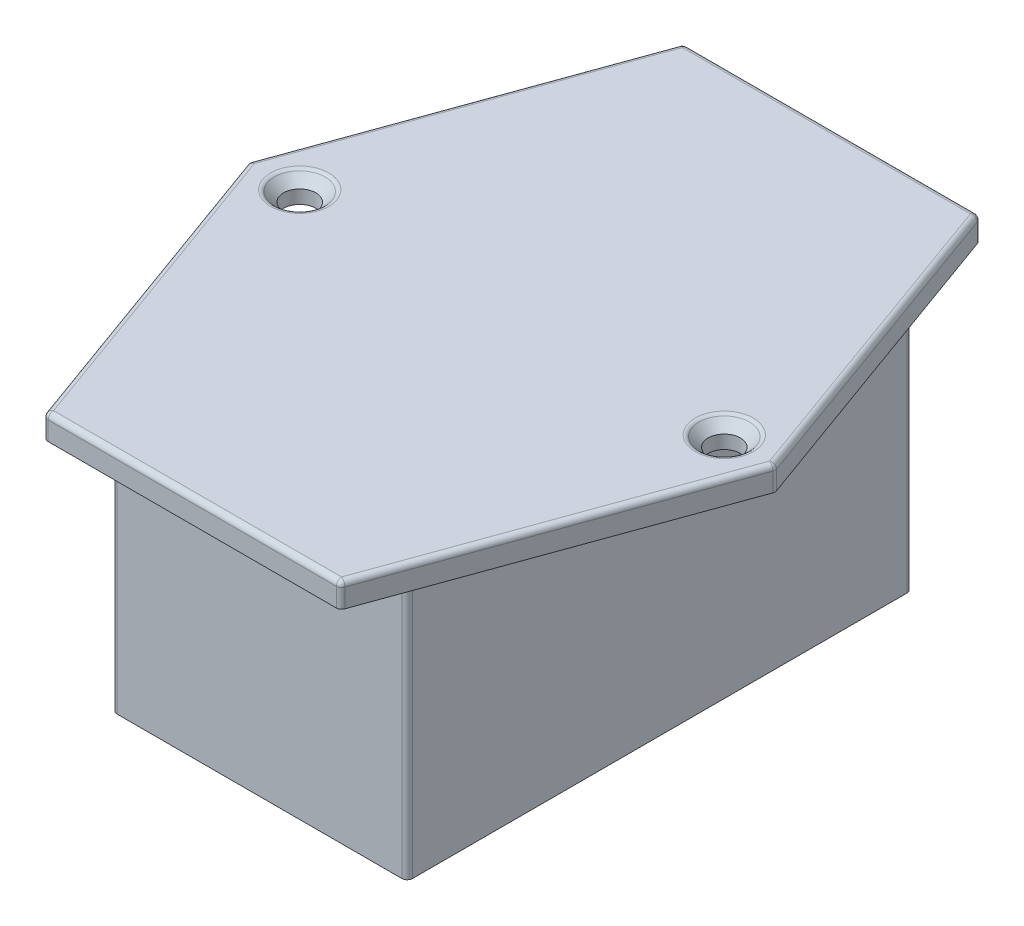
ISO-10303-21;
HEADER;
FILE_DESCRIPTION(('STEP AP214'),'2;1');
FILE_NAME('part.step','',(''),(''),'','','');
FILE_SCHEMA(('AUTOMOTIVE_DESIGN { 1 0 10303 214 1 1 1 1 }'));
ENDSEC;
DATA;
#1=APPLICATION_CONTEXT('core data for automotive mechanical design processes');
#2=APPLICATION_PROTOCOL_DEFINITION('international standard','automotive_design',2000,#1);
#3=PRODUCT_CONTEXT('',#1,'mechanical');
#4=PRODUCT('Part','Part','',(#3));
#5=PRODUCT_RELATED_PRODUCT_CATEGORY('part','',(#4));
#6=PRODUCT_DEFINITION_FORMATION('','',#4);
#7=PRODUCT_DEFINITION_CONTEXT('part definition',#1,'design');
#8=PRODUCT_DEFINITION('design','',#6,#7);
#9=PRODUCT_DEFINITION_SHAPE('','',#8);
#10=(LENGTH_UNIT() NAMED_UNIT(*) SI_UNIT(.MILLI.,.METRE.));
#11=(NAMED_UNIT(*) PLANE_ANGLE_UNIT() SI_UNIT($,.RADIAN.));
#12=(NAMED_UNIT(*) SI_UNIT($,.STERADIAN.) SOLID_ANGLE_UNIT());
#13=UNCERTAINTY_MEASURE_WITH_UNIT(LENGTH_MEASURE(1.E-05),#10,'distance_accuracy_value','');
#14=(GEOMETRIC_REPRESENTATION_CONTEXT(3) GLOBAL_UNCERTAINTY_ASSIGNED_CONTEXT((#13)) GLOBAL_UNIT_ASSIGNED_CONTEXT((#10,
#11,#12)) REPRESENTATION_CONTEXT('',''));
#15=CARTESIAN_POINT('',(0.,0.,0.));
#16=DIRECTION('',(0.,0.,1.));
#17=DIRECTION('',(1.,0.,0.));
#18=AXIS2_PLACEMENT_3D('',#15,#16,#17);
#19=CARTESIAN_POINT('',(0.,25.,0.));
#20=DIRECTION('',(1.,0.,0.));
#21=DIRECTION('',(0.,0.,-1.));
#22=AXIS2_PLACEMENT_3D('',#19,#20,#21);
#23=PLANE('',#22);
#24=DIRECTION('',(0.,0.,1.));
#25=VECTOR('',#24,1.);
#26=CARTESIAN_POINT('',(0.,25.,0.));
#27=LINE('',#26,#25);
#28=CARTESIAN_POINT('',(0.,25.,-46.5));
#29=VERTEX_POINT('',#28);
#30=CARTESIAN_POINT('',(0.,25.,-0.5));
#31=VERTEX_POINT('',#30);
#32=EDGE_CURVE('E385',#29,#31,#27,.T.);
#33=ORIENTED_EDGE('',*,*,#32,.F.);
#34=DIRECTION('',(0.,-1.,0.));
#35=VECTOR('',#34,1.);
#36=CARTESIAN_POINT('',(0.,25.,-46.5));
#37=LINE('',#36,#35);
#38=CARTESIAN_POINT('',(0.,0.,-46.5));
#39=VERTEX_POINT('',#38);
#40=EDGE_CURVE('E288',#29,#39,#37,.T.);
#41=ORIENTED_EDGE('',*,*,#40,.T.);
#42=DIRECTION('',(0.,0.,1.));
#43=VECTOR('',#42,1.);
#44=CARTESIAN_POINT('',(0.,0.,0.));
#45=LINE('',#44,#43);
#46=CARTESIAN_POINT('',(0.,0.,-0.5));
#47=VERTEX_POINT('',#46);
#48=EDGE_CURVE('E384',#39,#47,#45,.T.);
#49=ORIENTED_EDGE('',*,*,#48,.T.);
#50=DIRECTION('',(0.,-1.,0.));
#51=VECTOR('',#50,1.);
#52=CARTESIAN_POINT('',(0.,25.,-0.5));
#53=LINE('',#52,#51);
#54=EDGE_CURVE('E286',#47,#31,#53,.F.);
#55=ORIENTED_EDGE('',*,*,#54,.T.);
#56=EDGE_LOOP('',(#33,#41,#49,#55));
#57=FACE_BOUND('',#56,.T.);
#58=ADVANCED_FACE('F33',(#57),#23,.F.);
#59=CARTESIAN_POINT('',(0.,25.,0.));
#60=DIRECTION('',(0.,0.,-1.));
#61=DIRECTION('',(-1.,0.,0.));
#62=AXIS2_PLACEMENT_3D('',#59,#60,#61);
#63=PLANE('',#62);
#64=DIRECTION('',(1.,0.,0.));
#65=VECTOR('',#64,1.);
#66=CARTESIAN_POINT('',(0.,25.,0.));
#67=LINE('',#66,#65);
#68=CARTESIAN_POINT('',(0.5,25.,0.));
#69=VERTEX_POINT('',#68);
#70=CARTESIAN_POINT('',(27.,25.,0.));
#71=VERTEX_POINT('',#70);
#72=EDGE_CURVE('E388',#69,#71,#67,.T.);
#73=ORIENTED_EDGE('',*,*,#72,.F.);
#74=DIRECTION('',(0.,-1.,0.));
#75=VECTOR('',#74,1.);
#76=CARTESIAN_POINT('',(0.5,25.,0.));
#77=LINE('',#76,#75);
#78=CARTESIAN_POINT('',(0.5,0.,0.));
#79=VERTEX_POINT('',#78);
#80=EDGE_CURVE('E304',#69,#79,#77,.T.);
#81=ORIENTED_EDGE('',*,*,#80,.T.);
#82=DIRECTION('',(1.,0.,0.));
#83=VECTOR('',#82,1.);
#84=CARTESIAN_POINT('',(0.,0.,0.));
#85=LINE('',#84,#83);
#86=CARTESIAN_POINT('',(27.,0.,0.));
#87=VERTEX_POINT('',#86);
#88=EDGE_CURVE('E401',#79,#87,#85,.T.);
#89=ORIENTED_EDGE('',*,*,#88,.T.);
#90=DIRECTION('',(0.,-1.,0.));
#91=VECTOR('',#90,1.);
#92=CARTESIAN_POINT('',(27.,25.,0.));
#93=LINE('',#92,#91);
#94=EDGE_CURVE('E302',#87,#71,#93,.F.);
#95=ORIENTED_EDGE('',*,*,#94,.T.);
#96=EDGE_LOOP('',(#73,#81,#89,#95));
#97=FACE_BOUND('',#96,.T.);
#98=ADVANCED_FACE('F510',(#97),#63,.F.);
#99=CARTESIAN_POINT('',(27.5,25.,0.));
#100=DIRECTION('',(-1.,0.,0.));
#101=DIRECTION('',(0.,0.,1.));
#102=AXIS2_PLACEMENT_3D('',#99,#100,#101);
#103=PLANE('',#102);
#104=DIRECTION('',(0.,0.,-1.));
#105=VECTOR('',#104,1.);
#106=CARTESIAN_POINT('',(27.5,25.,0.));
#107=LINE('',#106,#105);
#108=CARTESIAN_POINT('',(27.5,25.,-0.5));
#109=VERTEX_POINT('',#108);
#110=CARTESIAN_POINT('',(27.5,25.,-46.5));
#111=VERTEX_POINT('',#110);
#112=EDGE_CURVE('E392',#109,#111,#107,.T.);
#113=ORIENTED_EDGE('',*,*,#112,.F.);
#114=DIRECTION('',(0.,-1.,0.));
#115=VECTOR('',#114,1.);
#116=CARTESIAN_POINT('',(27.5,25.,-0.5));
#117=LINE('',#116,#115);
#118=CARTESIAN_POINT('',(27.5,0.,-0.5));
#119=VERTEX_POINT('',#118);
#120=EDGE_CURVE('E308',#109,#119,#117,.T.);
#121=ORIENTED_EDGE('',*,*,#120,.T.);
#122=DIRECTION('',(0.,0.,-1.));
#123=VECTOR('',#122,1.);
#124=CARTESIAN_POINT('',(27.5,0.,0.));
#125=LINE('',#124,#123);
#126=CARTESIAN_POINT('',(27.5,0.,-46.5));
#127=VERTEX_POINT('',#126);
#128=EDGE_CURVE('E403',#119,#127,#125,.T.);
#129=ORIENTED_EDGE('',*,*,#128,.T.);
#130=DIRECTION('',(0.,-1.,0.));
#131=VECTOR('',#130,1.);
#132=CARTESIAN_POINT('',(27.5,25.,-46.5));
#133=LINE('',#132,#131);
#134=EDGE_CURVE('E306',#127,#111,#133,.F.);
#135=ORIENTED_EDGE('',*,*,#134,.T.);
#136=EDGE_LOOP('',(#113,#121,#129,#135));
#137=FACE_BOUND('',#136,.T.);
#138=ADVANCED_FACE('F516',(#137),#103,.F.);
#139=CARTESIAN_POINT('',(0.,25.,-47.));
#140=DIRECTION('',(0.,0.,1.));
#141=DIRECTION('',(1.,0.,0.));
#142=AXIS2_PLACEMENT_3D('',#139,#140,#141);
#143=PLANE('',#142);
#144=DIRECTION('',(-1.,0.,0.));
#145=VECTOR('',#144,1.);
#146=CARTESIAN_POINT('',(0.,0.,-47.));
#147=LINE('',#146,#145);
#148=CARTESIAN_POINT('',(27.,0.,-47.));
#149=VERTEX_POINT('',#148);
#150=CARTESIAN_POINT('',(0.5,0.,-47.));
#151=VERTEX_POINT('',#150);
#152=EDGE_CURVE('E389',#149,#151,#147,.T.);
#153=ORIENTED_EDGE('',*,*,#152,.T.);
#154=DIRECTION('',(0.,-1.,0.));
#155=VECTOR('',#154,1.);
#156=CARTESIAN_POINT('',(0.5,25.,-47.));
#157=LINE('',#156,#155);
#158=CARTESIAN_POINT('',(0.5,25.,-47.));
#159=VERTEX_POINT('',#158);
#160=EDGE_CURVE('E300',#151,#159,#157,.F.);
#161=ORIENTED_EDGE('',*,*,#160,.T.);
#162=DIRECTION('',(-1.,0.,0.));
#163=VECTOR('',#162,1.);
#164=CARTESIAN_POINT('',(0.,25.,-47.));
#165=LINE('',#164,#163);
#166=CARTESIAN_POINT('',(27.,25.,-47.));
#167=VERTEX_POINT('',#166);
#168=EDGE_CURVE('E395',#167,#159,#165,.T.);
#169=ORIENTED_EDGE('',*,*,#168,.F.);
#170=DIRECTION('',(0.,-1.,0.));
#171=VECTOR('',#170,1.);
#172=CARTESIAN_POINT('',(27.,25.,-47.));
#173=LINE('',#172,#171);
#174=EDGE_CURVE('E297',#167,#149,#173,.T.);
#175=ORIENTED_EDGE('',*,*,#174,.T.);
#176=EDGE_LOOP('',(#153,#161,#169,#175));
#177=FACE_BOUND('',#176,.T.);
#178=ADVANCED_FACE('F603',(#177),#143,.F.);
#179=CARTESIAN_POINT('',(0.,0.,0.));
#180=DIRECTION('',(0.,-1.,0.));
#181=DIRECTION('',(0.,0.,-1.));
#182=AXIS2_PLACEMENT_3D('',#179,#180,#181);
#183=PLANE('',#182);
#184=ORIENTED_EDGE('',*,*,#48,.F.);
#185=CARTESIAN_POINT('',(0.5,0.,-46.5));
#186=DIRECTION('',(0.,-1.,0.));
#187=DIRECTION('',(0.,0.,-1.));
#188=AXIS2_PLACEMENT_3D('',#185,#186,#187);
#189=CIRCLE('',#188,0.5);
#190=EDGE_CURVE('E295',#39,#151,#189,.T.);
#191=ORIENTED_EDGE('',*,*,#190,.T.);
#192=ORIENTED_EDGE('',*,*,#152,.F.);
#193=CARTESIAN_POINT('',(27.,0.,-46.5));
#194=DIRECTION('',(0.,-1.,0.));
#195=DIRECTION('',(0.,0.,-1.));
#196=AXIS2_PLACEMENT_3D('',#193,#194,#195);
#197=CIRCLE('',#196,0.5);
#198=EDGE_CURVE('E291',#149,#127,#197,.T.);
#199=ORIENTED_EDGE('',*,*,#198,.T.);
#200=ORIENTED_EDGE('',*,*,#128,.F.);
#201=CARTESIAN_POINT('',(27.,0.,-0.5));
#202=DIRECTION('',(0.,-1.,0.));
#203=DIRECTION('',(0.,0.,-1.));
#204=AXIS2_PLACEMENT_3D('',#201,#202,#203);
#205=CIRCLE('',#204,0.5);
#206=EDGE_CURVE('E50',#119,#87,#205,.T.);
#207=ORIENTED_EDGE('',*,*,#206,.T.);
#208=ORIENTED_EDGE('',*,*,#88,.F.);
#209=CARTESIAN_POINT('',(0.5,0.,-0.5));
#210=DIRECTION('',(0.,-1.,0.));
#211=DIRECTION('',(0.,0.,-1.));
#212=AXIS2_PLACEMENT_3D('',#209,#210,#211);
#213=CIRCLE('',#212,0.5);
#214=EDGE_CURVE('E58',#79,#47,#213,.T.);
#215=ORIENTED_EDGE('',*,*,#214,.T.);
#216=EDGE_LOOP('',(#184,#191,#192,#199,#200,#207,#208,#215));
#217=FACE_BOUND('',#216,.T.);
#218=ADVANCED_FACE('F609',(#217),#183,.T.);
#219=CARTESIAN_POINT('',(0.,27.25,0.));
#220=DIRECTION('',(0.,-1.,0.));
#221=DIRECTION('',(0.,0.,-1.));
#222=AXIS2_PLACEMENT_3D('',#219,#220,#221);
#223=PLANE('',#222);
#224=DIRECTION('',(-0.339838665473642,0.,-0.940483748636357));
#225=VECTOR('',#224,1.);
#226=CARTESIAN_POINT('',(40.873152878961,27.25,-14.7692905360952));
#227=LINE('',#226,#225);
#228=CARTESIAN_POINT('',(37.7183587029282,27.25,-23.5));
#229=VERTEX_POINT('',#228);
#230=CARTESIAN_POINT('',(27.1490309718357,27.25,-52.75));
#231=VERTEX_POINT('',#230);
#232=EDGE_CURVE('E226',#229,#231,#227,.T.);
#233=ORIENTED_EDGE('',*,*,#232,.T.);
#234=DIRECTION('',(-1.,0.,0.));
#235=VECTOR('',#234,1.);
#236=CARTESIAN_POINT('',(0.,27.25,-52.75));
#237=LINE('',#236,#235);
#238=CARTESIAN_POINT('',(0.350969028164248,27.25,-52.75));
#239=VERTEX_POINT('',#238);
#240=EDGE_CURVE('E196',#231,#239,#237,.T.);
#241=ORIENTED_EDGE('',*,*,#240,.T.);
#242=DIRECTION('',(-0.339838665473641,0.,0.940483748636357));
#243=VECTOR('',#242,1.);
#244=CARTESIAN_POINT('',(-16.5491366391109,27.25,-5.9799401300989));
#245=LINE('',#244,#243);
#246=CARTESIAN_POINT('',(-10.2183587029282,27.25,-23.5));
#247=VERTEX_POINT('',#246);
#248=EDGE_CURVE('E214',#239,#247,#245,.T.);
#249=ORIENTED_EDGE('',*,*,#248,.T.);
#250=DIRECTION('',(0.339838665473642,0.,0.940483748636357));
#251=VECTOR('',#250,1.);
#252=CARTESIAN_POINT('',(-1.52733776340824,27.25,0.55189515820634));
#253=LINE('',#252,#251);
#254=CARTESIAN_POINT('',(0.350969028164256,27.25,5.75));
#255=VERTEX_POINT('',#254);
#256=EDGE_CURVE('E220',#247,#255,#253,.T.);
#257=ORIENTED_EDGE('',*,*,#256,.T.);
#258=DIRECTION('',(1.,0.,0.));
#259=VECTOR('',#258,1.);
#260=CARTESIAN_POINT('',(0.,27.25,5.75));
#261=LINE('',#260,#259);
#262=CARTESIAN_POINT('',(27.1490309718358,27.25,5.74999999999999));
#263=VERTEX_POINT('',#262);
#264=EDGE_CURVE('E419',#255,#263,#261,.T.);
#265=ORIENTED_EDGE('',*,*,#264,.T.);
#266=DIRECTION('',(0.339838665473641,0.,-0.940483748636357));
#267=VECTOR('',#266,1.);
#268=CARTESIAN_POINT('',(25.8513540032583,27.25,9.34124556420259));
#269=LINE('',#268,#267);
#270=EDGE_CURVE('E231',#263,#229,#269,.T.);
#271=ORIENTED_EDGE('',*,*,#270,.T.);
#272=EDGE_LOOP('',(#233,#241,#249,#257,#265,#271));
#273=FACE_BOUND('',#272,.T.);
#274=CARTESIAN_POINT('',(33.5,27.25,-23.5));
#275=DIRECTION('',(0.,-1.,0.));
#276=DIRECTION('',(0.,0.,-1.));
#277=AXIS2_PLACEMENT_3D('',#274,#275,#276);
#278=CIRCLE('',#277,2.70710678118654);
#279=CARTESIAN_POINT('',(33.5,27.25,-26.2071067811865));
#280=VERTEX_POINT('',#279);
#281=EDGE_CURVE('E221',#280,#280,#278,.T.);
#282=ORIENTED_EDGE('',*,*,#281,.T.);
#283=EDGE_LOOP('',(#282));
#284=FACE_BOUND('',#283,.T.);
#285=CARTESIAN_POINT('',(-6.,27.25,-23.5));
#286=DIRECTION('',(0.,-1.,0.));
#287=DIRECTION('',(0.,0.,-1.));
#288=AXIS2_PLACEMENT_3D('',#285,#286,#287);
#289=CIRCLE('',#288,2.70710678118654);
#290=CARTESIAN_POINT('',(-6.,27.25,-26.2071067811865));
#291=VERTEX_POINT('',#290);
#292=EDGE_CURVE('E413',#291,#291,#289,.T.);
#293=ORIENTED_EDGE('',*,*,#292,.T.);
#294=EDGE_LOOP('',(#293));
#295=FACE_BOUND('',#294,.T.);
#296=ADVANCED_FACE('F223',(#273,#284,#295),#223,.F.);
#297=CARTESIAN_POINT('',(0.,25.,0.));
#298=DIRECTION('',(0.,-1.,0.));
#299=DIRECTION('',(0.,0.,-1.));
#300=AXIS2_PLACEMENT_3D('',#297,#298,#299);
#301=PLANE('',#300);
#302=ORIENTED_EDGE('',*,*,#112,.T.);
#303=CARTESIAN_POINT('',(27.,25.,-46.5));
#304=DIRECTION('',(0.,-1.,0.));
#305=DIRECTION('',(0.,0.,-1.));
#306=AXIS2_PLACEMENT_3D('',#303,#304,#305);
#307=CIRCLE('',#306,0.5);
#308=EDGE_CURVE('E11',#111,#167,#307,.F.);
#309=ORIENTED_EDGE('',*,*,#308,.T.);
#310=ORIENTED_EDGE('',*,*,#168,.T.);
#311=CARTESIAN_POINT('',(0.5,25.,-46.5));
#312=DIRECTION('',(0.,-1.,0.));
#313=DIRECTION('',(0.,0.,-1.));
#314=AXIS2_PLACEMENT_3D('',#311,#312,#313);
#315=CIRCLE('',#314,0.5);
#316=EDGE_CURVE('E311',#159,#29,#315,.F.);
#317=ORIENTED_EDGE('',*,*,#316,.T.);
#318=ORIENTED_EDGE('',*,*,#32,.T.);
#319=CARTESIAN_POINT('',(0.5,25.,-0.5));
#320=DIRECTION('',(0.,-1.,0.));
#321=DIRECTION('',(0.,0.,-1.));
#322=AXIS2_PLACEMENT_3D('',#319,#320,#321);
#323=CIRCLE('',#322,0.5);
#324=EDGE_CURVE('E313',#31,#69,#323,.F.);
#325=ORIENTED_EDGE('',*,*,#324,.T.);
#326=ORIENTED_EDGE('',*,*,#72,.T.);
#327=CARTESIAN_POINT('',(27.,25.,-0.5));
#328=DIRECTION('',(0.,-1.,0.));
#329=DIRECTION('',(0.,0.,-1.));
#330=AXIS2_PLACEMENT_3D('',#327,#328,#329);
#331=CIRCLE('',#330,0.5);
#332=EDGE_CURVE('E42',#71,#109,#331,.F.);
#333=ORIENTED_EDGE('',*,*,#332,.T.);
#334=EDGE_LOOP('',(#302,#309,#310,#317,#318,#325,#326,#333));
#335=FACE_BOUND('',#334,.T.);
#336=CARTESIAN_POINT('',(-6.,25.,-23.5));
#337=DIRECTION('',(0.,1.,0.));
#338=DIRECTION('',(0.,0.,1.));
#339=AXIS2_PLACEMENT_3D('',#336,#337,#338);
#340=CIRCLE('',#339,1.5);
#341=CARTESIAN_POINT('',(-6.,25.,-22.));
#342=VERTEX_POINT('',#341);
#343=EDGE_CURVE('E359',#342,#342,#340,.T.);
#344=ORIENTED_EDGE('',*,*,#343,.T.);
#345=EDGE_LOOP('',(#344));
#346=FACE_BOUND('',#345,.T.);
#347=DIRECTION('',(0.339838665473642,0.,0.940483748636357));
#348=VECTOR('',#347,1.);
#349=CARTESIAN_POINT('',(0.,25.,6.25));
#350=LINE('',#349,#348);
#351=CARTESIAN_POINT('',(-10.6886005772464,25.,-23.3300806672632));
#352=VERTEX_POINT('',#351);
#353=CARTESIAN_POINT('',(-0.119272846153922,25.,5.91991933273682));
#354=VERTEX_POINT('',#353);
#355=EDGE_CURVE('E369',#352,#354,#350,.T.);
#356=ORIENTED_EDGE('',*,*,#355,.F.);
#357=CARTESIAN_POINT('',(-10.2183587029282,25.,-23.5));
#358=DIRECTION('',(0.,-1.,0.));
#359=DIRECTION('',(0.,0.,-1.));
#360=AXIS2_PLACEMENT_3D('',#357,#358,#359);
#361=CIRCLE('',#360,0.5);
#362=CARTESIAN_POINT('',(-10.6886005772464,25.,-23.6699193327368));
#363=VERTEX_POINT('',#362);
#364=EDGE_CURVE('E284',#352,#363,#361,.T.);
#365=ORIENTED_EDGE('',*,*,#364,.T.);
#366=DIRECTION('',(-0.339838665473641,0.,0.940483748636357));
#367=VECTOR('',#366,1.);
#368=CARTESIAN_POINT('',(-10.75,25.,-23.5));
#369=LINE('',#368,#367);
#370=CARTESIAN_POINT('',(-0.119272846153927,25.,-52.9199193327368));
#371=VERTEX_POINT('',#370);
#372=EDGE_CURVE('E364',#371,#363,#369,.T.);
#373=ORIENTED_EDGE('',*,*,#372,.F.);
#374=CARTESIAN_POINT('',(0.350969028164252,25.,-52.75));
#375=DIRECTION('',(0.,-1.,0.));
#376=DIRECTION('',(0.,0.,-1.));
#377=AXIS2_PLACEMENT_3D('',#374,#375,#376);
#378=CIRCLE('',#377,0.5);
#379=CARTESIAN_POINT('',(0.350969028164252,25.,-53.25));
#380=VERTEX_POINT('',#379);
#381=EDGE_CURVE('E282',#371,#380,#378,.T.);
#382=ORIENTED_EDGE('',*,*,#381,.T.);
#383=DIRECTION('',(-1.,0.,0.));
#384=VECTOR('',#383,1.);
#385=CARTESIAN_POINT('',(0.,25.,-53.25));
#386=LINE('',#385,#384);
#387=CARTESIAN_POINT('',(27.1490309718357,25.,-53.25));
#388=VERTEX_POINT('',#387);
#389=EDGE_CURVE('E381',#388,#380,#386,.T.);
#390=ORIENTED_EDGE('',*,*,#389,.F.);
#391=CARTESIAN_POINT('',(27.1490309718357,25.,-52.75));
#392=DIRECTION('',(0.,-1.,0.));
#393=DIRECTION('',(0.,0.,-1.));
#394=AXIS2_PLACEMENT_3D('',#391,#392,#393);
#395=CIRCLE('',#394,0.5);
#396=CARTESIAN_POINT('',(27.6192728461539,25.,-52.9199193327368));
#397=VERTEX_POINT('',#396);
#398=EDGE_CURVE('E280',#388,#397,#395,.T.);
#399=ORIENTED_EDGE('',*,*,#398,.T.);
#400=DIRECTION('',(-0.339838665473642,0.,-0.940483748636357));
#401=VECTOR('',#400,1.);
#402=CARTESIAN_POINT('',(27.5,25.,-53.25));
#403=LINE('',#402,#401);
#404=CARTESIAN_POINT('',(38.1886005772464,25.,-23.6699193327368));
#405=VERTEX_POINT('',#404);
#406=EDGE_CURVE('E378',#405,#397,#403,.T.);
#407=ORIENTED_EDGE('',*,*,#406,.F.);
#408=CARTESIAN_POINT('',(37.7183587029282,25.,-23.5));
#409=DIRECTION('',(0.,-1.,0.));
#410=DIRECTION('',(0.,0.,-1.));
#411=AXIS2_PLACEMENT_3D('',#408,#409,#410);
#412=CIRCLE('',#411,0.5);
#413=CARTESIAN_POINT('',(38.1886005772464,25.,-23.3300806672632));
#414=VERTEX_POINT('',#413);
#415=EDGE_CURVE('E278',#405,#414,#412,.T.);
#416=ORIENTED_EDGE('',*,*,#415,.T.);
#417=DIRECTION('',(0.339838665473641,0.,-0.940483748636357));
#418=VECTOR('',#417,1.);
#419=CARTESIAN_POINT('',(38.25,25.,-23.5));
#420=LINE('',#419,#418);
#421=CARTESIAN_POINT('',(27.6192728461539,25.,5.91991933273682));
#422=VERTEX_POINT('',#421);
#423=EDGE_CURVE('E375',#422,#414,#420,.T.);
#424=ORIENTED_EDGE('',*,*,#423,.F.);
#425=CARTESIAN_POINT('',(27.1490309718357,25.,5.74999999999999));
#426=DIRECTION('',(0.,-1.,0.));
#427=DIRECTION('',(0.,0.,-1.));
#428=AXIS2_PLACEMENT_3D('',#425,#426,#427);
#429=CIRCLE('',#428,0.5);
#430=CARTESIAN_POINT('',(27.1490309718357,25.,6.25));
#431=VERTEX_POINT('',#430);
#432=EDGE_CURVE('E276',#422,#431,#429,.T.);
#433=ORIENTED_EDGE('',*,*,#432,.T.);
#434=DIRECTION('',(1.,0.,0.));
#435=VECTOR('',#434,1.);
#436=CARTESIAN_POINT('',(27.5,25.,6.25));
#437=LINE('',#436,#435);
#438=CARTESIAN_POINT('',(0.350969028164255,25.,6.25));
#439=VERTEX_POINT('',#438);
#440=EDGE_CURVE('E372',#439,#431,#437,.T.);
#441=ORIENTED_EDGE('',*,*,#440,.F.);
#442=CARTESIAN_POINT('',(0.350969028164255,25.,5.75));
#443=DIRECTION('',(0.,-1.,0.));
#444=DIRECTION('',(0.,0.,-1.));
#445=AXIS2_PLACEMENT_3D('',#442,#443,#444);
#446=CIRCLE('',#445,0.5);
#447=EDGE_CURVE('E274',#439,#354,#446,.T.);
#448=ORIENTED_EDGE('',*,*,#447,.T.);
#449=EDGE_LOOP('',(#356,#365,#373,#382,#390,#399,#407,#416,#424,#433,#441,#448));
#450=FACE_BOUND('',#449,.T.);
#451=CARTESIAN_POINT('',(33.5,25.,-23.5));
#452=DIRECTION('',(0.,1.,0.));
#453=DIRECTION('',(0.,0.,1.));
#454=AXIS2_PLACEMENT_3D('',#451,#452,#453);
#455=CIRCLE('',#454,1.5);
#456=CARTESIAN_POINT('',(33.5,25.,-22.));
#457=VERTEX_POINT('',#456);
#458=EDGE_CURVE('E356',#457,#457,#455,.T.);
#459=ORIENTED_EDGE('',*,*,#458,.T.);
#460=EDGE_LOOP('',(#459));
#461=FACE_BOUND('',#460,.T.);
#462=ADVANCED_FACE('F456',(#335,#346,#450,#461),#301,.T.);
#463=CARTESIAN_POINT('',(-10.75,27.25,-23.5));
#464=DIRECTION('',(0.940483748636357,0.,0.339838665473641));
#465=DIRECTION('',(0.339838665473641,0.,-0.940483748636357));
#466=AXIS2_PLACEMENT_3D('',#463,#464,#465);
#467=PLANE('',#466);
#468=ORIENTED_EDGE('',*,*,#372,.T.);
#469=DIRECTION('',(0.,-1.,0.));
#470=VECTOR('',#469,1.);
#471=CARTESIAN_POINT('',(-10.6886005772464,27.25,-23.6699193327368));
#472=LINE('',#471,#470);
#473=CARTESIAN_POINT('',(-10.6886005772464,26.75,-23.6699193327368));
#474=VERTEX_POINT('',#473);
#475=EDGE_CURVE('E266',#363,#474,#472,.F.);
#476=ORIENTED_EDGE('',*,*,#475,.T.);
#477=DIRECTION('',(-0.339838665473641,0.,0.940483748636357));
#478=VECTOR('',#477,1.);
#479=CARTESIAN_POINT('',(-10.75,26.75,-23.5));
#480=LINE('',#479,#478);
#481=CARTESIAN_POINT('',(-0.119272846153928,26.75,-52.9199193327368));
#482=VERTEX_POINT('',#481);
#483=EDGE_CURVE('E264',#474,#482,#480,.F.);
#484=ORIENTED_EDGE('',*,*,#483,.T.);
#485=DIRECTION('',(0.,-1.,0.));
#486=VECTOR('',#485,1.);
#487=CARTESIAN_POINT('',(-0.119272846153927,27.25,-52.9199193327368));
#488=LINE('',#487,#486);
#489=EDGE_CURVE('E262',#482,#371,#488,.T.);
#490=ORIENTED_EDGE('',*,*,#489,.T.);
#491=EDGE_LOOP('',(#468,#476,#484,#490));
#492=FACE_BOUND('',#491,.T.);
#493=ADVANCED_FACE('F452',(#492),#467,.F.);
#494=CARTESIAN_POINT('',(0.,27.25,6.25));
#495=DIRECTION('',(0.940483748636357,0.,-0.339838665473642));
#496=DIRECTION('',(-0.339838665473642,0.,-0.940483748636357));
#497=AXIS2_PLACEMENT_3D('',#494,#495,#496);
#498=PLANE('',#497);
#499=DIRECTION('',(0.339838665473642,0.,0.940483748636357));
#500=VECTOR('',#499,1.);
#501=CARTESIAN_POINT('',(0.,26.75,6.25));
#502=LINE('',#501,#500);
#503=CARTESIAN_POINT('',(-0.119272846153922,26.75,5.91991933273682));
#504=VERTEX_POINT('',#503);
#505=CARTESIAN_POINT('',(-10.6886005772464,26.75,-23.3300806672632));
#506=VERTEX_POINT('',#505);
#507=EDGE_CURVE('E258',#504,#506,#502,.F.);
#508=ORIENTED_EDGE('',*,*,#507,.T.);
#509=DIRECTION('',(0.,-1.,0.));
#510=VECTOR('',#509,1.);
#511=CARTESIAN_POINT('',(-10.6886005772464,27.25,-23.3300806672632));
#512=LINE('',#511,#510);
#513=EDGE_CURVE('E260',#506,#352,#512,.T.);
#514=ORIENTED_EDGE('',*,*,#513,.T.);
#515=ORIENTED_EDGE('',*,*,#355,.T.);
#516=DIRECTION('',(0.,-1.,0.));
#517=VECTOR('',#516,1.);
#518=CARTESIAN_POINT('',(-0.119272846153922,27.25,5.91991933273682));
#519=LINE('',#518,#517);
#520=EDGE_CURVE('E256',#354,#504,#519,.F.);
#521=ORIENTED_EDGE('',*,*,#520,.T.);
#522=EDGE_LOOP('',(#508,#514,#515,#521));
#523=FACE_BOUND('',#522,.T.);
#524=ADVANCED_FACE('F656',(#523),#498,.F.);
#525=CARTESIAN_POINT('',(27.5,27.25,6.25));
#526=DIRECTION('',(0.,0.,-1.));
#527=DIRECTION('',(-1.,0.,0.));
#528=AXIS2_PLACEMENT_3D('',#525,#526,#527);
#529=PLANE('',#528);
#530=ORIENTED_EDGE('',*,*,#440,.T.);
#531=DIRECTION('',(0.,-1.,0.));
#532=VECTOR('',#531,1.);
#533=CARTESIAN_POINT('',(27.1490309718357,27.25,6.25));
#534=LINE('',#533,#532);
#535=CARTESIAN_POINT('',(27.1490309718357,26.75,6.25));
#536=VERTEX_POINT('',#535);
#537=EDGE_CURVE('E254',#431,#536,#534,.F.);
#538=ORIENTED_EDGE('',*,*,#537,.T.);
#539=DIRECTION('',(1.,0.,0.));
#540=VECTOR('',#539,1.);
#541=CARTESIAN_POINT('',(27.5,26.75,6.25));
#542=LINE('',#541,#540);
#543=CARTESIAN_POINT('',(0.350969028164255,26.75,6.25));
#544=VERTEX_POINT('',#543);
#545=EDGE_CURVE('E252',#536,#544,#542,.F.);
#546=ORIENTED_EDGE('',*,*,#545,.T.);
#547=DIRECTION('',(0.,-1.,0.));
#548=VECTOR('',#547,1.);
#549=CARTESIAN_POINT('',(0.350969028164255,27.25,6.25));
#550=LINE('',#549,#548);
#551=EDGE_CURVE('E250',#544,#439,#550,.T.);
#552=ORIENTED_EDGE('',*,*,#551,.T.);
#553=EDGE_LOOP('',(#530,#538,#546,#552));
#554=FACE_BOUND('',#553,.T.);
#555=ADVANCED_FACE('F483',(#554),#529,.F.);
#556=CARTESIAN_POINT('',(38.25,27.25,-23.5));
#557=DIRECTION('',(-0.940483748636357,0.,-0.339838665473641));
#558=DIRECTION('',(-0.339838665473641,0.,0.940483748636357));
#559=AXIS2_PLACEMENT_3D('',#556,#557,#558);
#560=PLANE('',#559);
#561=ORIENTED_EDGE('',*,*,#423,.T.);
#562=DIRECTION('',(0.,-1.,0.));
#563=VECTOR('',#562,1.);
#564=CARTESIAN_POINT('',(38.1886005772464,27.25,-23.3300806672632));
#565=LINE('',#564,#563);
#566=CARTESIAN_POINT('',(38.1886005772464,26.75,-23.3300806672632));
#567=VERTEX_POINT('',#566);
#568=EDGE_CURVE('E248',#414,#567,#565,.F.);
#569=ORIENTED_EDGE('',*,*,#568,.T.);
#570=DIRECTION('',(0.339838665473641,0.,-0.940483748636357));
#571=VECTOR('',#570,1.);
#572=CARTESIAN_POINT('',(38.25,26.75,-23.5));
#573=LINE('',#572,#571);
#574=CARTESIAN_POINT('',(27.6192728461539,26.75,5.91991933273682));
#575=VERTEX_POINT('',#574);
#576=EDGE_CURVE('E246',#567,#575,#573,.F.);
#577=ORIENTED_EDGE('',*,*,#576,.T.);
#578=DIRECTION('',(0.,-1.,0.));
#579=VECTOR('',#578,1.);
#580=CARTESIAN_POINT('',(27.6192728461539,27.25,5.91991933273682));
#581=LINE('',#580,#579);
#582=EDGE_CURVE('E244',#575,#422,#581,.T.);
#583=ORIENTED_EDGE('',*,*,#582,.T.);
#584=EDGE_LOOP('',(#561,#569,#577,#583));
#585=FACE_BOUND('',#584,.T.);
#586=ADVANCED_FACE('F491',(#585),#560,.F.);
#587=CARTESIAN_POINT('',(27.5,27.25,-53.25));
#588=DIRECTION('',(-0.940483748636357,0.,0.339838665473642));
#589=DIRECTION('',(0.339838665473642,0.,0.940483748636357));
#590=AXIS2_PLACEMENT_3D('',#587,#588,#589);
#591=PLANE('',#590);
#592=ORIENTED_EDGE('',*,*,#406,.T.);
#593=DIRECTION('',(0.,-1.,0.));
#594=VECTOR('',#593,1.);
#595=CARTESIAN_POINT('',(27.6192728461539,27.25,-52.9199193327368));
#596=LINE('',#595,#594);
#597=CARTESIAN_POINT('',(27.6192728461539,26.75,-52.9199193327368));
#598=VERTEX_POINT('',#597);
#599=EDGE_CURVE('E242',#397,#598,#596,.F.);
#600=ORIENTED_EDGE('',*,*,#599,.T.);
#601=DIRECTION('',(-0.339838665473642,0.,-0.940483748636357));
#602=VECTOR('',#601,1.);
#603=CARTESIAN_POINT('',(27.5,26.75,-53.25));
#604=LINE('',#603,#602);
#605=CARTESIAN_POINT('',(38.1886005772464,26.75,-23.6699193327368));
#606=VERTEX_POINT('',#605);
#607=EDGE_CURVE('E240',#598,#606,#604,.F.);
#608=ORIENTED_EDGE('',*,*,#607,.T.);
#609=DIRECTION('',(0.,-1.,0.));
#610=VECTOR('',#609,1.);
#611=CARTESIAN_POINT('',(38.1886005772464,27.25,-23.6699193327368));
#612=LINE('',#611,#610);
#613=EDGE_CURVE('E238',#606,#405,#612,.T.);
#614=ORIENTED_EDGE('',*,*,#613,.T.);
#615=EDGE_LOOP('',(#592,#600,#608,#614));
#616=FACE_BOUND('',#615,.T.);
#617=ADVANCED_FACE('F499',(#616),#591,.F.);
#618=CARTESIAN_POINT('',(0.,27.25,-53.25));
#619=DIRECTION('',(0.,0.,1.));
#620=DIRECTION('',(1.,0.,0.));
#621=AXIS2_PLACEMENT_3D('',#618,#619,#620);
#622=PLANE('',#621);
#623=ORIENTED_EDGE('',*,*,#389,.T.);
#624=DIRECTION('',(0.,-1.,0.));
#625=VECTOR('',#624,1.);
#626=CARTESIAN_POINT('',(0.350969028164252,27.25,-53.25));
#627=LINE('',#626,#625);
#628=CARTESIAN_POINT('',(0.350969028164252,26.75,-53.25));
#629=VERTEX_POINT('',#628);
#630=EDGE_CURVE('E236',#380,#629,#627,.F.);
#631=ORIENTED_EDGE('',*,*,#630,.T.);
#632=DIRECTION('',(-1.,0.,0.));
#633=VECTOR('',#632,1.);
#634=CARTESIAN_POINT('',(0.,26.75,-53.25));
#635=LINE('',#634,#633);
#636=CARTESIAN_POINT('',(27.1490309718357,26.75,-53.25));
#637=VERTEX_POINT('',#636);
#638=EDGE_CURVE('E198',#629,#637,#635,.F.);
#639=ORIENTED_EDGE('',*,*,#638,.T.);
#640=DIRECTION('',(0.,-1.,0.));
#641=VECTOR('',#640,1.);
#642=CARTESIAN_POINT('',(27.1490309718357,27.25,-53.25));
#643=LINE('',#642,#641);
#644=EDGE_CURVE('E228',#637,#388,#643,.T.);
#645=ORIENTED_EDGE('',*,*,#644,.T.);
#646=EDGE_LOOP('',(#623,#631,#639,#645));
#647=FACE_BOUND('',#646,.T.);
#648=ADVANCED_FACE('F444',(#647),#622,.F.);
#649=CARTESIAN_POINT('',(-6.,27.25,-23.5));
#650=DIRECTION('',(0.,-1.,0.));
#651=DIRECTION('',(0.,0.,-1.));
#652=AXIS2_PLACEMENT_3D('',#649,#650,#651);
#653=CYLINDRICAL_SURFACE('',#652,1.5);
#654=CARTESIAN_POINT('',(-6.,26.25,-23.5));
#655=DIRECTION('',(0.,-1.,0.));
#656=DIRECTION('',(0.,0.,-1.));
#657=AXIS2_PLACEMENT_3D('',#654,#655,#656);
#658=CIRCLE('',#657,1.5);
#659=CARTESIAN_POINT('',(-6.,26.25,-25.));
#660=VERTEX_POINT('',#659);
#661=EDGE_CURVE('E398',#660,#660,#658,.F.);
#662=ORIENTED_EDGE('',*,*,#661,.T.);
#663=EDGE_LOOP('',(#662));
#664=FACE_BOUND('',#663,.T.);
#665=ORIENTED_EDGE('',*,*,#343,.F.);
#666=EDGE_LOOP('',(#665));
#667=FACE_BOUND('',#666,.T.);
#668=ADVANCED_FACE('F506',(#664,#667),#653,.F.);
#669=CARTESIAN_POINT('',(33.5,27.25,-23.5));
#670=DIRECTION('',(0.,-1.,0.));
#671=DIRECTION('',(0.,0.,-1.));
#672=AXIS2_PLACEMENT_3D('',#669,#670,#671);
#673=CYLINDRICAL_SURFACE('',#672,1.5);
#674=CARTESIAN_POINT('',(33.5,26.25,-23.5));
#675=DIRECTION('',(0.,-1.,0.));
#676=DIRECTION('',(0.,0.,-1.));
#677=AXIS2_PLACEMENT_3D('',#674,#675,#676);
#678=CIRCLE('',#677,1.5);
#679=CARTESIAN_POINT('',(33.5,26.25,-25.));
#680=VERTEX_POINT('',#679);
#681=EDGE_CURVE('E410',#680,#680,#678,.F.);
#682=ORIENTED_EDGE('',*,*,#681,.T.);
#683=EDGE_LOOP('',(#682));
#684=FACE_BOUND('',#683,.T.);
#685=ORIENTED_EDGE('',*,*,#458,.F.);
#686=EDGE_LOOP('',(#685));
#687=FACE_BOUND('',#686,.T.);
#688=ADVANCED_FACE('F526',(#684,#687),#673,.F.);
#689=CARTESIAN_POINT('',(-6.,26.25,-23.5));
#690=DIRECTION('',(0.,1.,0.));
#691=DIRECTION('',(0.,0.,1.));
#692=AXIS2_PLACEMENT_3D('',#689,#690,#691);
#693=CONICAL_SURFACE('',#692,1.5,0.785398163397449);
#694=CARTESIAN_POINT('',(-6.,27.1035533905933,-23.5));
#695=DIRECTION('',(0.,1.,0.));
#696=DIRECTION('',(0.,0.,1.));
#697=AXIS2_PLACEMENT_3D('',#694,#695,#696);
#698=CIRCLE('',#697,2.35355339059327);
#699=CARTESIAN_POINT('',(-6.,27.1035533905933,-21.1464466094067));
#700=VERTEX_POINT('',#699);
#701=EDGE_CURVE('E271',#700,#700,#698,.T.);
#702=ORIENTED_EDGE('',*,*,#701,.T.);
#703=EDGE_LOOP('',(#702));
#704=FACE_BOUND('',#703,.T.);
#705=ORIENTED_EDGE('',*,*,#661,.F.);
#706=EDGE_LOOP('',(#705));
#707=FACE_BOUND('',#706,.T.);
#708=ADVANCED_FACE('F522',(#704,#707),#693,.F.);
#709=CARTESIAN_POINT('',(33.5,26.25,-23.5));
#710=DIRECTION('',(0.,1.,0.));
#711=DIRECTION('',(0.,0.,1.));
#712=AXIS2_PLACEMENT_3D('',#709,#710,#711);
#713=CONICAL_SURFACE('',#712,1.5,0.785398163397449);
#714=CARTESIAN_POINT('',(33.5,27.1035533905933,-23.5));
#715=DIRECTION('',(0.,1.,0.));
#716=DIRECTION('',(0.,0.,1.));
#717=AXIS2_PLACEMENT_3D('',#714,#715,#716);
#718=CIRCLE('',#717,2.35355339059327);
#719=CARTESIAN_POINT('',(33.5,27.1035533905933,-21.1464466094067));
#720=VERTEX_POINT('',#719);
#721=EDGE_CURVE('E268',#720,#720,#718,.T.);
#722=ORIENTED_EDGE('',*,*,#721,.T.);
#723=EDGE_LOOP('',(#722));
#724=FACE_BOUND('',#723,.T.);
#725=ORIENTED_EDGE('',*,*,#681,.F.);
#726=EDGE_LOOP('',(#725));
#727=FACE_BOUND('',#726,.T.);
#728=ADVANCED_FACE('F525',(#724,#727),#713,.F.);
#729=CARTESIAN_POINT('',(27.1490309718357,27.25,5.74999999999999));
#730=DIRECTION('',(0.,-1.,0.));
#731=DIRECTION('',(0.,0.,-1.));
#732=AXIS2_PLACEMENT_3D('',#729,#730,#731);
#733=CYLINDRICAL_SURFACE('',#732,0.5);
#734=ORIENTED_EDGE('',*,*,#432,.F.);
#735=ORIENTED_EDGE('',*,*,#582,.F.);
#736=CARTESIAN_POINT('',(27.1490309718357,26.75,5.74999999999999));
#737=DIRECTION('',(0.,1.,0.));
#738=DIRECTION('',(0.,0.,1.));
#739=AXIS2_PLACEMENT_3D('',#736,#737,#738);
#740=CIRCLE('',#739,0.5);
#741=EDGE_CURVE('E37',#536,#575,#740,.T.);
#742=ORIENTED_EDGE('',*,*,#741,.F.);
#743=ORIENTED_EDGE('',*,*,#537,.F.);
#744=EDGE_LOOP('',(#734,#735,#742,#743));
#745=FACE_BOUND('',#744,.T.);
#746=ADVANCED_FACE('F489',(#745),#733,.T.);
#747=CARTESIAN_POINT('',(0.,26.75,5.75));
#748=DIRECTION('',(1.,0.,0.));
#749=DIRECTION('',(0.,0.,-1.));
#750=AXIS2_PLACEMENT_3D('',#747,#748,#749);
#751=CYLINDRICAL_SURFACE('',#750,0.5);
#752=CARTESIAN_POINT('',(0.350969028164255,26.75,5.75));
#753=DIRECTION('',(-1.,0.,0.));
#754=DIRECTION('',(0.,-1.,0.));
#755=AXIS2_PLACEMENT_3D('',#752,#753,#754);
#756=CIRCLE('',#755,0.5);
#757=EDGE_CURVE('E348',#544,#255,#756,.T.);
#758=ORIENTED_EDGE('',*,*,#757,.F.);
#759=ORIENTED_EDGE('',*,*,#545,.F.);
#760=CARTESIAN_POINT('',(27.1490309718358,26.75,5.74999999999999));
#761=DIRECTION('',(1.,0.,0.));
#762=DIRECTION('',(0.,0.,-1.));
#763=AXIS2_PLACEMENT_3D('',#760,#761,#762);
#764=CIRCLE('',#763,0.5);
#765=EDGE_CURVE('E350',#263,#536,#764,.T.);
#766=ORIENTED_EDGE('',*,*,#765,.F.);
#767=ORIENTED_EDGE('',*,*,#264,.F.);
#768=EDGE_LOOP('',(#758,#759,#766,#767));
#769=FACE_BOUND('',#768,.T.);
#770=ADVANCED_FACE('F471',(#769),#751,.T.);
#771=CARTESIAN_POINT('',(0.350969028164255,27.25,5.75));
#772=DIRECTION('',(0.,-1.,0.));
#773=DIRECTION('',(0.,0.,-1.));
#774=AXIS2_PLACEMENT_3D('',#771,#772,#773);
#775=CYLINDRICAL_SURFACE('',#774,0.5);
#776=ORIENTED_EDGE('',*,*,#447,.F.);
#777=ORIENTED_EDGE('',*,*,#551,.F.);
#778=CARTESIAN_POINT('',(0.350969028164256,26.75,5.75));
#779=DIRECTION('',(0.,1.,0.));
#780=DIRECTION('',(0.,0.,1.));
#781=AXIS2_PLACEMENT_3D('',#778,#779,#780);
#782=CIRCLE('',#781,0.5);
#783=EDGE_CURVE('E345',#504,#544,#782,.T.);
#784=ORIENTED_EDGE('',*,*,#783,.F.);
#785=ORIENTED_EDGE('',*,*,#520,.F.);
#786=EDGE_LOOP('',(#776,#777,#784,#785));
#787=FACE_BOUND('',#786,.T.);
#788=ADVANCED_FACE('F480',(#787),#775,.T.);
#789=CARTESIAN_POINT('',(27.1490309718358,26.75,5.74999999999999));
#790=DIRECTION('',(0.,0.,1.));
#791=DIRECTION('',(1.,0.,0.));
#792=AXIS2_PLACEMENT_3D('',#789,#790,#791);
#793=SPHERICAL_SURFACE('',#792,0.5);
#794=ORIENTED_EDGE('',*,*,#765,.T.);
#795=ORIENTED_EDGE('',*,*,#741,.T.);
#796=CARTESIAN_POINT('',(27.1490309718357,26.75,5.74999999999999));
#797=DIRECTION('',(-0.339838665473641,0.,0.940483748636357));
#798=DIRECTION('',(0.940483748636357,0.,0.339838665473641));
#799=AXIS2_PLACEMENT_3D('',#796,#797,#798);
#800=CIRCLE('',#799,0.5);
#801=EDGE_CURVE('E342',#263,#575,#800,.F.);
#802=ORIENTED_EDGE('',*,*,#801,.F.);
#803=EDGE_LOOP('',(#794,#795,#802));
#804=FACE_BOUND('',#803,.T.);
#805=ADVANCED_FACE('F560',(#804),#793,.T.);
#806=CARTESIAN_POINT('',(0.350969028164256,26.75,5.75));
#807=DIRECTION('',(0.,0.,1.));
#808=DIRECTION('',(1.,0.,0.));
#809=AXIS2_PLACEMENT_3D('',#806,#807,#808);
#810=SPHERICAL_SURFACE('',#809,0.5);
#811=ORIENTED_EDGE('',*,*,#783,.T.);
#812=ORIENTED_EDGE('',*,*,#757,.T.);
#813=CARTESIAN_POINT('',(0.350969028164256,26.75,5.75));
#814=DIRECTION('',(0.33983866547364,0.,0.940483748636358));
#815=DIRECTION('',(0.940483748636358,0.,-0.33983866547364));
#816=AXIS2_PLACEMENT_3D('',#813,#814,#815);
#817=CIRCLE('',#816,0.5);
#818=EDGE_CURVE('E339',#504,#255,#817,.F.);
#819=ORIENTED_EDGE('',*,*,#818,.F.);
#820=EDGE_LOOP('',(#811,#812,#819));
#821=FACE_BOUND('',#820,.T.);
#822=ADVANCED_FACE('F474',(#821),#810,.T.);
#823=CARTESIAN_POINT('',(37.7183587029282,27.25,-23.5));
#824=DIRECTION('',(0.,-1.,0.));
#825=DIRECTION('',(0.,0.,-1.));
#826=AXIS2_PLACEMENT_3D('',#823,#824,#825);
#827=CYLINDRICAL_SURFACE('',#826,0.5);
#828=ORIENTED_EDGE('',*,*,#415,.F.);
#829=ORIENTED_EDGE('',*,*,#613,.F.);
#830=CARTESIAN_POINT('',(37.7183587029282,26.75,-23.5));
#831=DIRECTION('',(0.,1.,0.));
#832=DIRECTION('',(0.,0.,1.));
#833=AXIS2_PLACEMENT_3D('',#830,#831,#832);
#834=CIRCLE('',#833,0.5);
#835=EDGE_CURVE('E336',#567,#606,#834,.T.);
#836=ORIENTED_EDGE('',*,*,#835,.F.);
#837=ORIENTED_EDGE('',*,*,#568,.F.);
#838=EDGE_LOOP('',(#828,#829,#836,#837));
#839=FACE_BOUND('',#838,.T.);
#840=ADVANCED_FACE('F495',(#839),#827,.T.);
#841=CARTESIAN_POINT('',(25.8513540032583,26.75,9.34124556420259));
#842=DIRECTION('',(0.339838665473641,0.,-0.940483748636357));
#843=DIRECTION('',(-0.940483748636357,0.,-0.339838665473641));
#844=AXIS2_PLACEMENT_3D('',#841,#842,#843);
#845=CYLINDRICAL_SURFACE('',#844,0.5);
#846=ORIENTED_EDGE('',*,*,#801,.T.);
#847=ORIENTED_EDGE('',*,*,#576,.F.);
#848=CARTESIAN_POINT('',(37.7183587029282,26.75,-23.5));
#849=DIRECTION('',(0.339838665473645,0.,-0.940483748636356));
#850=DIRECTION('',(-0.940483748636356,0.,-0.339838665473645));
#851=AXIS2_PLACEMENT_3D('',#848,#849,#850);
#852=CIRCLE('',#851,0.5);
#853=EDGE_CURVE('E333',#229,#567,#852,.T.);
#854=ORIENTED_EDGE('',*,*,#853,.F.);
#855=ORIENTED_EDGE('',*,*,#270,.F.);
#856=EDGE_LOOP('',(#846,#847,#854,#855));
#857=FACE_BOUND('',#856,.T.);
#858=ADVANCED_FACE('F426',(#857),#845,.T.);
#859=CARTESIAN_POINT('',(-1.52733776340824,26.75,0.55189515820634));
#860=DIRECTION('',(0.339838665473642,0.,0.940483748636357));
#861=DIRECTION('',(0.940483748636357,0.,-0.339838665473642));
#862=AXIS2_PLACEMENT_3D('',#859,#860,#861);
#863=CYLINDRICAL_SURFACE('',#862,0.5);
#864=ORIENTED_EDGE('',*,*,#818,.T.);
#865=ORIENTED_EDGE('',*,*,#256,.F.);
#866=CARTESIAN_POINT('',(-10.2183587029282,26.75,-23.5));
#867=DIRECTION('',(-0.339838665473643,0.,-0.940483748636356));
#868=DIRECTION('',(-0.940483748636357,0.,0.339838665473643));
#869=AXIS2_PLACEMENT_3D('',#866,#867,#868);
#870=CIRCLE('',#869,0.5);
#871=EDGE_CURVE('E330',#506,#247,#870,.T.);
#872=ORIENTED_EDGE('',*,*,#871,.F.);
#873=ORIENTED_EDGE('',*,*,#507,.F.);
#874=EDGE_LOOP('',(#864,#865,#872,#873));
#875=FACE_BOUND('',#874,.T.);
#876=ADVANCED_FACE('F467',(#875),#863,.T.);
#877=CARTESIAN_POINT('',(-10.2183587029282,27.25,-23.5));
#878=DIRECTION('',(0.,-1.,0.));
#879=DIRECTION('',(0.,0.,-1.));
#880=AXIS2_PLACEMENT_3D('',#877,#878,#879);
#881=CYLINDRICAL_SURFACE('',#880,0.5);
#882=ORIENTED_EDGE('',*,*,#364,.F.);
#883=ORIENTED_EDGE('',*,*,#513,.F.);
#884=CARTESIAN_POINT('',(-10.2183587029282,26.75,-23.5));
#885=DIRECTION('',(0.,1.,0.));
#886=DIRECTION('',(0.,0.,1.));
#887=AXIS2_PLACEMENT_3D('',#884,#885,#886);
#888=CIRCLE('',#887,0.5);
#889=EDGE_CURVE('E327',#474,#506,#888,.T.);
#890=ORIENTED_EDGE('',*,*,#889,.F.);
#891=ORIENTED_EDGE('',*,*,#475,.F.);
#892=EDGE_LOOP('',(#882,#883,#890,#891));
#893=FACE_BOUND('',#892,.T.);
#894=ADVANCED_FACE('F460',(#893),#881,.T.);
#895=CARTESIAN_POINT('',(37.7183587029282,26.75,-23.5));
#896=DIRECTION('',(0.,0.,1.));
#897=DIRECTION('',(1.,0.,0.));
#898=AXIS2_PLACEMENT_3D('',#895,#896,#897);
#899=SPHERICAL_SURFACE('',#898,0.5);
#900=ORIENTED_EDGE('',*,*,#853,.T.);
#901=ORIENTED_EDGE('',*,*,#835,.T.);
#902=CARTESIAN_POINT('',(37.7183587029282,26.75,-23.5));
#903=DIRECTION('',(0.339838665473645,0.,0.940483748636356));
#904=DIRECTION('',(0.940483748636356,0.,-0.339838665473645));
#905=AXIS2_PLACEMENT_3D('',#902,#903,#904);
#906=CIRCLE('',#905,0.5);
#907=EDGE_CURVE('E324',#229,#606,#906,.F.);
#908=ORIENTED_EDGE('',*,*,#907,.F.);
#909=EDGE_LOOP('',(#900,#901,#908));
#910=FACE_BOUND('',#909,.T.);
#911=ADVANCED_FACE('F429',(#910),#899,.T.);
#912=CARTESIAN_POINT('',(-10.2183587029282,26.75,-23.5));
#913=DIRECTION('',(0.,0.,1.));
#914=DIRECTION('',(1.,0.,0.));
#915=AXIS2_PLACEMENT_3D('',#912,#913,#914);
#916=SPHERICAL_SURFACE('',#915,0.5);
#917=ORIENTED_EDGE('',*,*,#889,.T.);
#918=ORIENTED_EDGE('',*,*,#871,.T.);
#919=CARTESIAN_POINT('',(-10.2183587029282,26.75,-23.5));
#920=DIRECTION('',(-0.33983866547363,0.,0.940483748636361));
#921=DIRECTION('',(0.940483748636361,0.,0.33983866547363));
#922=AXIS2_PLACEMENT_3D('',#919,#920,#921);
#923=CIRCLE('',#922,0.5);
#924=EDGE_CURVE('E217',#474,#247,#923,.F.);
#925=ORIENTED_EDGE('',*,*,#924,.F.);
#926=EDGE_LOOP('',(#917,#918,#925));
#927=FACE_BOUND('',#926,.T.);
#928=ADVANCED_FACE('F464',(#927),#916,.T.);
#929=CARTESIAN_POINT('',(27.1490309718357,27.25,-52.75));
#930=DIRECTION('',(0.,-1.,0.));
#931=DIRECTION('',(0.,0.,-1.));
#932=AXIS2_PLACEMENT_3D('',#929,#930,#931);
#933=CYLINDRICAL_SURFACE('',#932,0.5);
#934=ORIENTED_EDGE('',*,*,#398,.F.);
#935=ORIENTED_EDGE('',*,*,#644,.F.);
#936=CARTESIAN_POINT('',(27.1490309718357,26.75,-52.75));
#937=DIRECTION('',(0.,1.,0.));
#938=DIRECTION('',(0.,0.,1.));
#939=AXIS2_PLACEMENT_3D('',#936,#937,#938);
#940=CIRCLE('',#939,0.5);
#941=EDGE_CURVE('E320',#598,#637,#940,.T.);
#942=ORIENTED_EDGE('',*,*,#941,.F.);
#943=ORIENTED_EDGE('',*,*,#599,.F.);
#944=EDGE_LOOP('',(#934,#935,#942,#943));
#945=FACE_BOUND('',#944,.T.);
#946=ADVANCED_FACE('F441',(#945),#933,.T.);
#947=CARTESIAN_POINT('',(40.873152878961,26.75,-14.7692905360952));
#948=DIRECTION('',(-0.339838665473642,0.,-0.940483748636357));
#949=DIRECTION('',(-0.940483748636357,0.,0.339838665473642));
#950=AXIS2_PLACEMENT_3D('',#947,#948,#949);
#951=CYLINDRICAL_SURFACE('',#950,0.5);
#952=ORIENTED_EDGE('',*,*,#907,.T.);
#953=ORIENTED_EDGE('',*,*,#607,.F.);
#954=CARTESIAN_POINT('',(27.1490309718357,26.75,-52.75));
#955=DIRECTION('',(-0.339838665473647,0.,-0.940483748636355));
#956=DIRECTION('',(-0.940483748636355,0.,0.339838665473647));
#957=AXIS2_PLACEMENT_3D('',#954,#955,#956);
#958=CIRCLE('',#957,0.5);
#959=EDGE_CURVE('E211',#231,#598,#958,.T.);
#960=ORIENTED_EDGE('',*,*,#959,.F.);
#961=ORIENTED_EDGE('',*,*,#232,.F.);
#962=EDGE_LOOP('',(#952,#953,#960,#961));
#963=FACE_BOUND('',#962,.T.);
#964=ADVANCED_FACE('F432',(#963),#951,.T.);
#965=CARTESIAN_POINT('',(-16.5491366391109,26.75,-5.9799401300989));
#966=DIRECTION('',(-0.339838665473641,0.,0.940483748636357));
#967=DIRECTION('',(0.940483748636357,0.,0.339838665473641));
#968=AXIS2_PLACEMENT_3D('',#965,#966,#967);
#969=CYLINDRICAL_SURFACE('',#968,0.5);
#970=ORIENTED_EDGE('',*,*,#924,.T.);
#971=ORIENTED_EDGE('',*,*,#248,.F.);
#972=CARTESIAN_POINT('',(0.350969028164251,26.75,-52.75));
#973=DIRECTION('',(0.339838665473643,0.,-0.940483748636356));
#974=DIRECTION('',(-0.940483748636356,0.,-0.339838665473643));
#975=AXIS2_PLACEMENT_3D('',#972,#973,#974);
#976=CIRCLE('',#975,0.5);
#977=EDGE_CURVE('E204',#482,#239,#976,.T.);
#978=ORIENTED_EDGE('',*,*,#977,.F.);
#979=ORIENTED_EDGE('',*,*,#483,.F.);
#980=EDGE_LOOP('',(#970,#971,#978,#979));
#981=FACE_BOUND('',#980,.T.);
#982=ADVANCED_FACE('F215',(#981),#969,.T.);
#983=CARTESIAN_POINT('',(0.350969028164252,27.25,-52.75));
#984=DIRECTION('',(0.,-1.,0.));
#985=DIRECTION('',(0.,0.,-1.));
#986=AXIS2_PLACEMENT_3D('',#983,#984,#985);
#987=CYLINDRICAL_SURFACE('',#986,0.5);
#988=ORIENTED_EDGE('',*,*,#381,.F.);
#989=ORIENTED_EDGE('',*,*,#489,.F.);
#990=CARTESIAN_POINT('',(0.350969028164252,26.75,-52.75));
#991=DIRECTION('',(0.,1.,0.));
#992=DIRECTION('',(0.,0.,1.));
#993=AXIS2_PLACEMENT_3D('',#990,#991,#992);
#994=CIRCLE('',#993,0.5);
#995=EDGE_CURVE('E208',#629,#482,#994,.T.);
#996=ORIENTED_EDGE('',*,*,#995,.F.);
#997=ORIENTED_EDGE('',*,*,#630,.F.);
#998=EDGE_LOOP('',(#988,#989,#996,#997));
#999=FACE_BOUND('',#998,.T.);
#1000=ADVANCED_FACE('F449',(#999),#987,.T.);
#1001=CARTESIAN_POINT('',(27.1490309718357,26.75,-52.75));
#1002=DIRECTION('',(0.,0.,1.));
#1003=DIRECTION('',(1.,0.,0.));
#1004=AXIS2_PLACEMENT_3D('',#1001,#1002,#1003);
#1005=SPHERICAL_SURFACE('',#1004,0.5);
#1006=ORIENTED_EDGE('',*,*,#959,.T.);
#1007=ORIENTED_EDGE('',*,*,#941,.T.);
#1008=CARTESIAN_POINT('',(27.1490309718357,26.75,-52.75));
#1009=DIRECTION('',(1.,0.,0.));
#1010=DIRECTION('',(0.,1.,0.));
#1011=AXIS2_PLACEMENT_3D('',#1008,#1009,#1010);
#1012=CIRCLE('',#1011,0.5);
#1013=EDGE_CURVE('E201',#231,#637,#1012,.F.);
#1014=ORIENTED_EDGE('',*,*,#1013,.F.);
#1015=EDGE_LOOP('',(#1006,#1007,#1014));
#1016=FACE_BOUND('',#1015,.T.);
#1017=ADVANCED_FACE('F436',(#1016),#1005,.T.);
#1018=CARTESIAN_POINT('',(0.350969028164251,26.75,-52.75));
#1019=DIRECTION('',(0.,0.,1.));
#1020=DIRECTION('',(1.,0.,0.));
#1021=AXIS2_PLACEMENT_3D('',#1018,#1019,#1020);
#1022=SPHERICAL_SURFACE('',#1021,0.5);
#1023=ORIENTED_EDGE('',*,*,#995,.T.);
#1024=ORIENTED_EDGE('',*,*,#977,.T.);
#1025=CARTESIAN_POINT('',(0.350969028164248,26.75,-52.75));
#1026=DIRECTION('',(-1.,0.,0.));
#1027=DIRECTION('',(0.,0.,1.));
#1028=AXIS2_PLACEMENT_3D('',#1025,#1026,#1027);
#1029=CIRCLE('',#1028,0.5);
#1030=EDGE_CURVE('E192',#629,#239,#1029,.F.);
#1031=ORIENTED_EDGE('',*,*,#1030,.F.);
#1032=EDGE_LOOP('',(#1023,#1024,#1031));
#1033=FACE_BOUND('',#1032,.T.);
#1034=ADVANCED_FACE('F206',(#1033),#1022,.T.);
#1035=CARTESIAN_POINT('',(0.,26.75,-52.75));
#1036=DIRECTION('',(-1.,0.,0.));
#1037=DIRECTION('',(0.,0.,1.));
#1038=AXIS2_PLACEMENT_3D('',#1035,#1036,#1037);
#1039=CYLINDRICAL_SURFACE('',#1038,0.5);
#1040=ORIENTED_EDGE('',*,*,#1013,.T.);
#1041=ORIENTED_EDGE('',*,*,#638,.F.);
#1042=ORIENTED_EDGE('',*,*,#1030,.T.);
#1043=ORIENTED_EDGE('',*,*,#240,.F.);
#1044=EDGE_LOOP('',(#1040,#1041,#1042,#1043));
#1045=FACE_BOUND('',#1044,.T.);
#1046=ADVANCED_FACE('F194',(#1045),#1039,.T.);
#1047=CARTESIAN_POINT('',(33.5,26.75,-23.5));
#1048=DIRECTION('',(0.,-1.,0.));
#1049=DIRECTION('',(0.,0.,-1.));
#1050=AXIS2_PLACEMENT_3D('',#1047,#1048,#1049);
#1051=TOROIDAL_SURFACE('',#1050,2.70710678118654,0.5);
#1052=ORIENTED_EDGE('',*,*,#721,.F.);
#1053=EDGE_LOOP('',(#1052));
#1054=FACE_BOUND('',#1053,.T.);
#1055=ORIENTED_EDGE('',*,*,#281,.F.);
#1056=EDGE_LOOP('',(#1055));
#1057=FACE_BOUND('',#1056,.T.);
#1058=ADVANCED_FACE('F533',(#1054,#1057),#1051,.T.);
#1059=CARTESIAN_POINT('',(-6.,26.75,-23.5));
#1060=DIRECTION('',(0.,-1.,0.));
#1061=DIRECTION('',(0.,0.,-1.));
#1062=AXIS2_PLACEMENT_3D('',#1059,#1060,#1061);
#1063=TOROIDAL_SURFACE('',#1062,2.70710678118654,0.5);
#1064=ORIENTED_EDGE('',*,*,#701,.F.);
#1065=EDGE_LOOP('',(#1064));
#1066=FACE_BOUND('',#1065,.T.);
#1067=ORIENTED_EDGE('',*,*,#292,.F.);
#1068=EDGE_LOOP('',(#1067));
#1069=FACE_BOUND('',#1068,.T.);
#1070=ADVANCED_FACE('F571',(#1066,#1069),#1063,.T.);
#1071=CARTESIAN_POINT('',(0.5,25.,-46.5));
#1072=DIRECTION('',(0.,-1.,0.));
#1073=DIRECTION('',(0.,0.,-1.));
#1074=AXIS2_PLACEMENT_3D('',#1071,#1072,#1073);
#1075=CYLINDRICAL_SURFACE('',#1074,0.5);
#1076=ORIENTED_EDGE('',*,*,#316,.F.);
#1077=ORIENTED_EDGE('',*,*,#160,.F.);
#1078=ORIENTED_EDGE('',*,*,#190,.F.);
#1079=ORIENTED_EDGE('',*,*,#40,.F.);
#1080=EDGE_LOOP('',(#1076,#1077,#1078,#1079));
#1081=FACE_BOUND('',#1080,.T.);
#1082=ADVANCED_FACE('F575',(#1081),#1075,.T.);
#1083=CARTESIAN_POINT('',(0.5,25.,-0.5));
#1084=DIRECTION('',(0.,-1.,0.));
#1085=DIRECTION('',(0.,0.,-1.));
#1086=AXIS2_PLACEMENT_3D('',#1083,#1084,#1085);
#1087=CYLINDRICAL_SURFACE('',#1086,0.5);
#1088=ORIENTED_EDGE('',*,*,#324,.F.);
#1089=ORIENTED_EDGE('',*,*,#54,.F.);
#1090=ORIENTED_EDGE('',*,*,#214,.F.);
#1091=ORIENTED_EDGE('',*,*,#80,.F.);
#1092=EDGE_LOOP('',(#1088,#1089,#1090,#1091));
#1093=FACE_BOUND('',#1092,.T.);
#1094=ADVANCED_FACE('F579',(#1093),#1087,.T.);
#1095=CARTESIAN_POINT('',(27.,25.,-0.5));
#1096=DIRECTION('',(0.,-1.,0.));
#1097=DIRECTION('',(0.,0.,-1.));
#1098=AXIS2_PLACEMENT_3D('',#1095,#1096,#1097);
#1099=CYLINDRICAL_SURFACE('',#1098,0.5);
#1100=ORIENTED_EDGE('',*,*,#332,.F.);
#1101=ORIENTED_EDGE('',*,*,#94,.F.);
#1102=ORIENTED_EDGE('',*,*,#206,.F.);
#1103=ORIENTED_EDGE('',*,*,#120,.F.);
#1104=EDGE_LOOP('',(#1100,#1101,#1102,#1103));
#1105=FACE_BOUND('',#1104,.T.);
#1106=ADVANCED_FACE('F582',(#1105),#1099,.T.);
#1107=CARTESIAN_POINT('',(27.,25.,-46.5));
#1108=DIRECTION('',(0.,-1.,0.));
#1109=DIRECTION('',(0.,0.,-1.));
#1110=AXIS2_PLACEMENT_3D('',#1107,#1108,#1109);
#1111=CYLINDRICAL_SURFACE('',#1110,0.5);
#1112=ORIENTED_EDGE('',*,*,#308,.F.);
#1113=ORIENTED_EDGE('',*,*,#134,.F.);
#1114=ORIENTED_EDGE('',*,*,#198,.F.);
#1115=ORIENTED_EDGE('',*,*,#174,.F.);
#1116=EDGE_LOOP('',(#1112,#1113,#1114,#1115));
#1117=FACE_BOUND('',#1116,.T.);
#1118=ADVANCED_FACE('F35',(#1117),#1111,.T.);
#1119=CLOSED_SHELL('',(#58,#98,#138,#178,#218,#296,#462,#493,#524,#555,#586,#617,#648,#668,#688,
#708,#728,#746,#770,#788,#805,#822,#840,#858,#876,#894,#911,#928,#946,#964,#982,#1000,#1017,
#1034,#1046,#1058,#1070,#1082,#1094,#1106,#1118));
#1120=MANIFOLD_SOLID_BREP('B2',#1119);
#1121=ADVANCED_BREP_SHAPE_REPRESENTATION('',(#18,#1120),#14);
#1122=SHAPE_DEFINITION_REPRESENTATION(#9,#1121);
ENDSEC;
END-ISO-10303-21;
